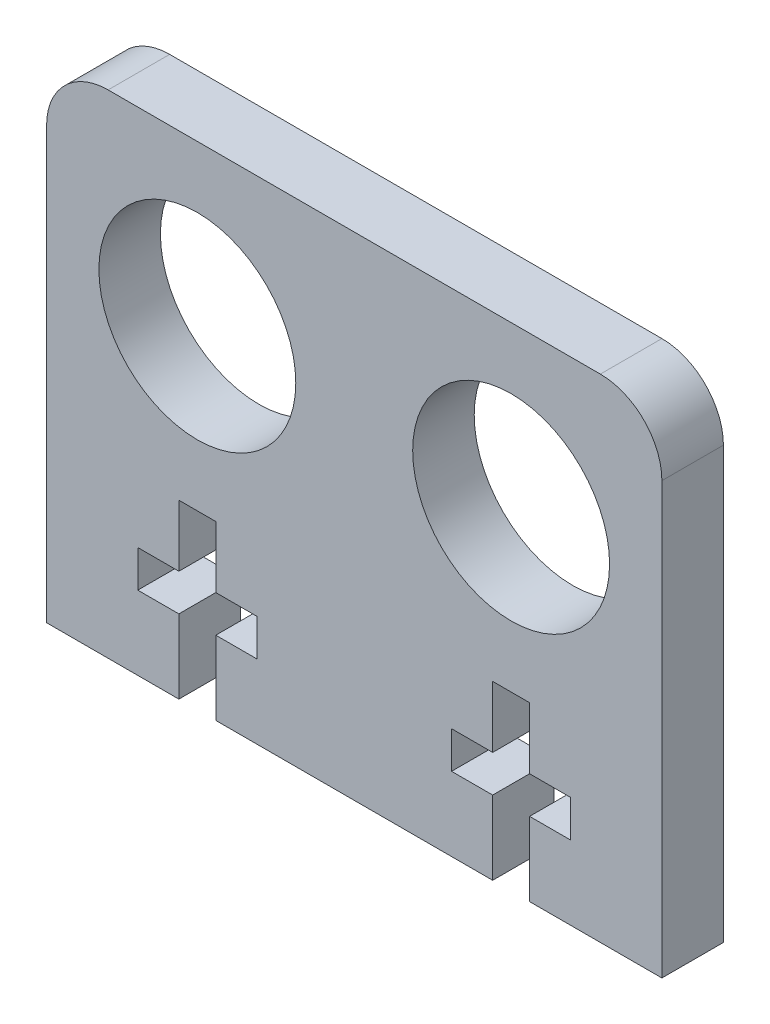
ISO-10303-21;
HEADER;
FILE_DESCRIPTION(('STEP AP214'),'2;1');
FILE_NAME('part.step','',(''),(''),'','','');
FILE_SCHEMA(('AUTOMOTIVE_DESIGN { 1 0 10303 214 1 1 1 1 }'));
ENDSEC;
DATA;
#1=APPLICATION_CONTEXT('core data for automotive mechanical design processes');
#2=APPLICATION_PROTOCOL_DEFINITION('international standard','automotive_design',2000,#1);
#3=PRODUCT_CONTEXT('',#1,'mechanical');
#4=PRODUCT('Part','Part','',(#3));
#5=PRODUCT_RELATED_PRODUCT_CATEGORY('part','',(#4));
#6=PRODUCT_DEFINITION_FORMATION('','',#4);
#7=PRODUCT_DEFINITION_CONTEXT('part definition',#1,'design');
#8=PRODUCT_DEFINITION('design','',#6,#7);
#9=PRODUCT_DEFINITION_SHAPE('','',#8);
#10=(LENGTH_UNIT() NAMED_UNIT(*) SI_UNIT(.MILLI.,.METRE.));
#11=(NAMED_UNIT(*) PLANE_ANGLE_UNIT() SI_UNIT($,.RADIAN.));
#12=(NAMED_UNIT(*) SI_UNIT($,.STERADIAN.) SOLID_ANGLE_UNIT());
#13=UNCERTAINTY_MEASURE_WITH_UNIT(LENGTH_MEASURE(1.E-05),#10,'distance_accuracy_value','');
#14=(GEOMETRIC_REPRESENTATION_CONTEXT(3) GLOBAL_UNCERTAINTY_ASSIGNED_CONTEXT((#13)) GLOBAL_UNIT_ASSIGNED_CONTEXT((#10,
#11,#12)) REPRESENTATION_CONTEXT('',''));
#15=CARTESIAN_POINT('',(0.,0.,0.));
#16=DIRECTION('',(0.,0.,1.));
#17=DIRECTION('',(1.,0.,0.));
#18=AXIS2_PLACEMENT_3D('',#15,#16,#17);
#19=CARTESIAN_POINT('',(-18.9894864370583,-13.233633688483,5.));
#20=DIRECTION('',(0.,1.,0.));
#21=DIRECTION('',(-1.,0.,0.));
#22=AXIS2_PLACEMENT_3D('',#19,#20,#21);
#23=PLANE('',#22);
#24=DIRECTION('',(1.,0.,0.));
#25=VECTOR('',#24,1.);
#26=CARTESIAN_POINT('',(-18.9894864370583,-13.233633688483,5.));
#27=LINE('',#26,#25);
#28=CARTESIAN_POINT('',(-5.23989682395063,-13.233633688483,5.));
#29=VERTEX_POINT('',#28);
#30=CARTESIAN_POINT('',(17.2601031760494,-13.233633688483,5.));
#31=VERTEX_POINT('',#30);
#32=EDGE_CURVE('E380',#29,#31,#27,.T.);
#33=ORIENTED_EDGE('',*,*,#32,.F.);
#34=DIRECTION('',(0.,0.,1.));
#35=VECTOR('',#34,1.);
#36=CARTESIAN_POINT('',(-5.23989682395063,-13.233633688483,-5.));
#37=LINE('',#36,#35);
#38=CARTESIAN_POINT('',(-5.23989682395063,-13.233633688483,0.));
#39=VERTEX_POINT('',#38);
#40=EDGE_CURVE('E297',#39,#29,#37,.T.);
#41=ORIENTED_EDGE('',*,*,#40,.F.);
#42=DIRECTION('',(1.,0.,0.));
#43=VECTOR('',#42,1.);
#44=CARTESIAN_POINT('',(-18.9894864370583,-13.233633688483,0.));
#45=LINE('',#44,#43);
#46=CARTESIAN_POINT('',(17.2601031760494,-13.233633688483,0.));
#47=VERTEX_POINT('',#46);
#48=EDGE_CURVE('E391',#39,#47,#45,.T.);
#49=ORIENTED_EDGE('',*,*,#48,.T.);
#50=DIRECTION('',(0.,0.,1.));
#51=VECTOR('',#50,1.);
#52=CARTESIAN_POINT('',(17.2601031760494,-13.233633688483,-5.));
#53=LINE('',#52,#51);
#54=EDGE_CURVE('E355',#47,#31,#53,.T.);
#55=ORIENTED_EDGE('',*,*,#54,.T.);
#56=EDGE_LOOP('',(#33,#41,#49,#55));
#57=FACE_BOUND('',#56,.T.);
#58=ADVANCED_FACE('F33',(#57),#23,.F.);
#59=CARTESIAN_POINT('',(20.2601031760494,-13.233633688483,5.));
#60=VERTEX_POINT('',#59);
#61=CARTESIAN_POINT('',(31.0105135629417,-13.233633688483,5.));
#62=VERTEX_POINT('',#61);
#63=EDGE_CURVE('E375',#60,#62,#27,.T.);
#64=ORIENTED_EDGE('',*,*,#63,.F.);
#65=DIRECTION('',(0.,0.,1.));
#66=VECTOR('',#65,1.);
#67=CARTESIAN_POINT('',(20.2601031760494,-13.233633688483,-5.));
#68=LINE('',#67,#66);
#69=CARTESIAN_POINT('',(20.2601031760494,-13.233633688483,0.));
#70=VERTEX_POINT('',#69);
#71=EDGE_CURVE('E353',#70,#60,#68,.T.);
#72=ORIENTED_EDGE('',*,*,#71,.F.);
#73=CARTESIAN_POINT('',(31.0105135629417,-13.233633688483,0.));
#74=VERTEX_POINT('',#73);
#75=EDGE_CURVE('E386',#70,#74,#45,.T.);
#76=ORIENTED_EDGE('',*,*,#75,.T.);
#77=DIRECTION('',(0.,0.,-1.));
#78=VECTOR('',#77,1.);
#79=CARTESIAN_POINT('',(31.0105135629417,-13.233633688483,5.));
#80=LINE('',#79,#78);
#81=EDGE_CURVE('E384',#62,#74,#80,.T.);
#82=ORIENTED_EDGE('',*,*,#81,.F.);
#83=EDGE_LOOP('',(#64,#72,#76,#82));
#84=FACE_BOUND('',#83,.T.);
#85=ADVANCED_FACE('F542',(#84),#23,.F.);
#86=CARTESIAN_POINT('',(-18.9894864370583,26.766366311517,5.));
#87=DIRECTION('',(1.,0.,0.));
#88=DIRECTION('',(0.,1.,0.));
#89=AXIS2_PLACEMENT_3D('',#86,#87,#88);
#90=PLANE('',#89);
#91=DIRECTION('',(0.,-1.,0.));
#92=VECTOR('',#91,1.);
#93=CARTESIAN_POINT('',(-18.9894864370583,26.766366311517,5.));
#94=LINE('',#93,#92);
#95=CARTESIAN_POINT('',(-18.9894864370583,21.766366311517,5.));
#96=VERTEX_POINT('',#95);
#97=CARTESIAN_POINT('',(-18.9894864370583,-13.233633688483,5.));
#98=VERTEX_POINT('',#97);
#99=EDGE_CURVE('E373',#96,#98,#94,.T.);
#100=ORIENTED_EDGE('',*,*,#99,.F.);
#101=DIRECTION('',(0.,0.,-1.));
#102=VECTOR('',#101,1.);
#103=CARTESIAN_POINT('',(-18.9894864370583,21.766366311517,5.));
#104=LINE('',#103,#102);
#105=CARTESIAN_POINT('',(-18.9894864370583,21.766366311517,0.));
#106=VERTEX_POINT('',#105);
#107=EDGE_CURVE('E462',#96,#106,#104,.T.);
#108=ORIENTED_EDGE('',*,*,#107,.T.);
#109=DIRECTION('',(0.,-1.,0.));
#110=VECTOR('',#109,1.);
#111=CARTESIAN_POINT('',(-18.9894864370583,26.766366311517,0.));
#112=LINE('',#111,#110);
#113=CARTESIAN_POINT('',(-18.9894864370583,-13.233633688483,0.));
#114=VERTEX_POINT('',#113);
#115=EDGE_CURVE('E370',#106,#114,#112,.T.);
#116=ORIENTED_EDGE('',*,*,#115,.T.);
#117=DIRECTION('',(0.,0.,-1.));
#118=VECTOR('',#117,1.);
#119=CARTESIAN_POINT('',(-18.9894864370583,-13.233633688483,5.));
#120=LINE('',#119,#118);
#121=EDGE_CURVE('E396',#98,#114,#120,.T.);
#122=ORIENTED_EDGE('',*,*,#121,.F.);
#123=EDGE_LOOP('',(#100,#108,#116,#122));
#124=FACE_BOUND('',#123,.T.);
#125=ADVANCED_FACE('F495',(#124),#90,.F.);
#126=CARTESIAN_POINT('',(-8.23989682395063,-13.233633688483,0.));
#127=VERTEX_POINT('',#126);
#128=EDGE_CURVE('E387',#114,#127,#45,.T.);
#129=ORIENTED_EDGE('',*,*,#128,.T.);
#130=DIRECTION('',(0.,0.,1.));
#131=VECTOR('',#130,1.);
#132=CARTESIAN_POINT('',(-8.23989682395063,-13.233633688483,-5.));
#133=LINE('',#132,#131);
#134=CARTESIAN_POINT('',(-8.23989682395063,-13.233633688483,5.));
#135=VERTEX_POINT('',#134);
#136=EDGE_CURVE('E299',#127,#135,#133,.T.);
#137=ORIENTED_EDGE('',*,*,#136,.T.);
#138=EDGE_CURVE('E377',#98,#135,#27,.T.);
#139=ORIENTED_EDGE('',*,*,#138,.F.);
#140=ORIENTED_EDGE('',*,*,#121,.T.);
#141=EDGE_LOOP('',(#129,#137,#139,#140));
#142=FACE_BOUND('',#141,.T.);
#143=ADVANCED_FACE('F497',(#142),#23,.F.);
#144=CARTESIAN_POINT('',(31.0105135629417,-13.233633688483,5.));
#145=DIRECTION('',(-1.,0.,0.));
#146=DIRECTION('',(0.,0.,1.));
#147=AXIS2_PLACEMENT_3D('',#144,#145,#146);
#148=PLANE('',#147);
#149=DIRECTION('',(0.,1.,0.));
#150=VECTOR('',#149,1.);
#151=CARTESIAN_POINT('',(31.0105135629417,-13.233633688483,0.));
#152=LINE('',#151,#150);
#153=CARTESIAN_POINT('',(31.0105135629417,21.766366311517,0.));
#154=VERTEX_POINT('',#153);
#155=EDGE_CURVE('E390',#74,#154,#152,.T.);
#156=ORIENTED_EDGE('',*,*,#155,.T.);
#157=DIRECTION('',(0.,0.,-1.));
#158=VECTOR('',#157,1.);
#159=CARTESIAN_POINT('',(31.0105135629417,21.766366311517,5.));
#160=LINE('',#159,#158);
#161=CARTESIAN_POINT('',(31.0105135629417,21.766366311517,5.));
#162=VERTEX_POINT('',#161);
#163=EDGE_CURVE('E41',#154,#162,#160,.F.);
#164=ORIENTED_EDGE('',*,*,#163,.T.);
#165=DIRECTION('',(0.,1.,0.));
#166=VECTOR('',#165,1.);
#167=CARTESIAN_POINT('',(31.0105135629417,-13.233633688483,5.));
#168=LINE('',#167,#166);
#169=EDGE_CURVE('E379',#62,#162,#168,.T.);
#170=ORIENTED_EDGE('',*,*,#169,.F.);
#171=ORIENTED_EDGE('',*,*,#81,.T.);
#172=EDGE_LOOP('',(#156,#164,#170,#171));
#173=FACE_BOUND('',#172,.T.);
#174=ADVANCED_FACE('F544',(#173),#148,.F.);
#175=CARTESIAN_POINT('',(31.0105135629417,26.766366311517,5.));
#176=DIRECTION('',(0.,-1.,0.));
#177=DIRECTION('',(1.,0.,0.));
#178=AXIS2_PLACEMENT_3D('',#175,#176,#177);
#179=PLANE('',#178);
#180=DIRECTION('',(-1.,0.,0.));
#181=VECTOR('',#180,1.);
#182=CARTESIAN_POINT('',(31.0105135629417,26.766366311517,5.));
#183=LINE('',#182,#181);
#184=CARTESIAN_POINT('',(26.0105135629417,26.766366311517,5.));
#185=VERTEX_POINT('',#184);
#186=CARTESIAN_POINT('',(-13.9894864370583,26.766366311517,5.));
#187=VERTEX_POINT('',#186);
#188=EDGE_CURVE('E382',#185,#187,#183,.T.);
#189=ORIENTED_EDGE('',*,*,#188,.F.);
#190=DIRECTION('',(0.,0.,-1.));
#191=VECTOR('',#190,1.);
#192=CARTESIAN_POINT('',(26.0105135629417,26.766366311517,5.));
#193=LINE('',#192,#191);
#194=CARTESIAN_POINT('',(26.0105135629417,26.766366311517,0.));
#195=VERTEX_POINT('',#194);
#196=EDGE_CURVE('E473',#185,#195,#193,.T.);
#197=ORIENTED_EDGE('',*,*,#196,.T.);
#198=DIRECTION('',(-1.,0.,0.));
#199=VECTOR('',#198,1.);
#200=CARTESIAN_POINT('',(31.0105135629417,26.766366311517,0.));
#201=LINE('',#200,#199);
#202=CARTESIAN_POINT('',(-13.9894864370583,26.766366311517,0.));
#203=VERTEX_POINT('',#202);
#204=EDGE_CURVE('E376',#195,#203,#201,.T.);
#205=ORIENTED_EDGE('',*,*,#204,.T.);
#206=DIRECTION('',(0.,0.,-1.));
#207=VECTOR('',#206,1.);
#208=CARTESIAN_POINT('',(-13.9894864370583,26.766366311517,5.));
#209=LINE('',#208,#207);
#210=EDGE_CURVE('E468',#203,#187,#209,.F.);
#211=ORIENTED_EDGE('',*,*,#210,.T.);
#212=EDGE_LOOP('',(#189,#197,#205,#211));
#213=FACE_BOUND('',#212,.T.);
#214=ADVANCED_FACE('F479',(#213),#179,.F.);
#215=CARTESIAN_POINT('',(0.,0.,5.));
#216=DIRECTION('',(0.,0.,1.));
#217=DIRECTION('',(1.,0.,0.));
#218=AXIS2_PLACEMENT_3D('',#215,#216,#217);
#219=PLANE('',#218);
#220=ORIENTED_EDGE('',*,*,#169,.T.);
#221=CARTESIAN_POINT('',(26.0105135629417,21.766366311517,5.));
#222=DIRECTION('',(0.,0.,1.));
#223=DIRECTION('',(1.,0.,0.));
#224=AXIS2_PLACEMENT_3D('',#221,#222,#223);
#225=CIRCLE('',#224,5.);
#226=EDGE_CURVE('E11',#162,#185,#225,.T.);
#227=ORIENTED_EDGE('',*,*,#226,.T.);
#228=ORIENTED_EDGE('',*,*,#188,.T.);
#229=CARTESIAN_POINT('',(-13.9894864370583,21.766366311517,5.));
#230=DIRECTION('',(0.,0.,1.));
#231=DIRECTION('',(1.,0.,0.));
#232=AXIS2_PLACEMENT_3D('',#229,#230,#231);
#233=CIRCLE('',#232,5.);
#234=EDGE_CURVE('E471',#187,#96,#233,.T.);
#235=ORIENTED_EDGE('',*,*,#234,.T.);
#236=ORIENTED_EDGE('',*,*,#99,.T.);
#237=ORIENTED_EDGE('',*,*,#138,.T.);
#238=DIRECTION('',(0.,-1.,0.));
#239=VECTOR('',#238,1.);
#240=CARTESIAN_POINT('',(-8.23989682395063,-13.233633688483,5.));
#241=LINE('',#240,#239);
#242=CARTESIAN_POINT('',(-8.23989682395063,-7.23363368848302,5.));
#243=VERTEX_POINT('',#242);
#244=EDGE_CURVE('E255',#243,#135,#241,.T.);
#245=ORIENTED_EDGE('',*,*,#244,.F.);
#246=DIRECTION('',(1.,0.,0.));
#247=VECTOR('',#246,1.);
#248=CARTESIAN_POINT('',(-8.23989682395063,-7.23363368848302,5.));
#249=LINE('',#248,#247);
#250=CARTESIAN_POINT('',(-11.5798968239506,-7.23363368848302,5.));
#251=VERTEX_POINT('',#250);
#252=EDGE_CURVE('E234',#251,#243,#249,.T.);
#253=ORIENTED_EDGE('',*,*,#252,.F.);
#254=DIRECTION('',(0.,-1.,0.));
#255=VECTOR('',#254,1.);
#256=CARTESIAN_POINT('',(-11.5798968239506,-7.23363368848302,5.));
#257=LINE('',#256,#255);
#258=CARTESIAN_POINT('',(-11.5798968239506,-4.23363368848298,5.));
#259=VERTEX_POINT('',#258);
#260=EDGE_CURVE('E244',#259,#251,#257,.T.);
#261=ORIENTED_EDGE('',*,*,#260,.F.);
#262=DIRECTION('',(-1.,0.,0.));
#263=VECTOR('',#262,1.);
#264=CARTESIAN_POINT('',(-11.5798968239506,-4.23363368848298,5.));
#265=LINE('',#264,#263);
#266=CARTESIAN_POINT('',(-8.23989682395063,-4.23363368848299,5.));
#267=VERTEX_POINT('',#266);
#268=EDGE_CURVE('E241',#267,#259,#265,.T.);
#269=ORIENTED_EDGE('',*,*,#268,.F.);
#270=DIRECTION('',(0.,-1.,0.));
#271=VECTOR('',#270,1.);
#272=CARTESIAN_POINT('',(-8.23989682395063,-4.23363368848299,5.));
#273=LINE('',#272,#271);
#274=CARTESIAN_POINT('',(-8.23989682395063,0.766366311517015,5.));
#275=VERTEX_POINT('',#274);
#276=EDGE_CURVE('E277',#275,#267,#273,.T.);
#277=ORIENTED_EDGE('',*,*,#276,.F.);
#278=DIRECTION('',(-1.,0.,0.));
#279=VECTOR('',#278,1.);
#280=CARTESIAN_POINT('',(-8.23989682395063,0.766366311517015,5.));
#281=LINE('',#280,#279);
#282=CARTESIAN_POINT('',(-5.23989682395063,0.766366311517015,5.));
#283=VERTEX_POINT('',#282);
#284=EDGE_CURVE('E274',#283,#275,#281,.T.);
#285=ORIENTED_EDGE('',*,*,#284,.F.);
#286=DIRECTION('',(0.,1.,0.));
#287=VECTOR('',#286,1.);
#288=CARTESIAN_POINT('',(-5.23989682395063,0.766366311517015,5.));
#289=LINE('',#288,#287);
#290=CARTESIAN_POINT('',(-5.23989682395063,-4.23363368848299,5.));
#291=VERTEX_POINT('',#290);
#292=EDGE_CURVE('E271',#291,#283,#289,.T.);
#293=ORIENTED_EDGE('',*,*,#292,.F.);
#294=DIRECTION('',(-1.,0.,0.));
#295=VECTOR('',#294,1.);
#296=CARTESIAN_POINT('',(-5.23989682395063,-4.23363368848299,5.));
#297=LINE('',#296,#295);
#298=CARTESIAN_POINT('',(-1.89989682395061,-4.23363368848298,5.));
#299=VERTEX_POINT('',#298);
#300=EDGE_CURVE('E268',#299,#291,#297,.T.);
#301=ORIENTED_EDGE('',*,*,#300,.F.);
#302=DIRECTION('',(0.,1.,0.));
#303=VECTOR('',#302,1.);
#304=CARTESIAN_POINT('',(-1.89989682395061,-4.23363368848298,5.));
#305=LINE('',#304,#303);
#306=CARTESIAN_POINT('',(-1.89989682395061,-7.23363368848302,5.));
#307=VERTEX_POINT('',#306);
#308=EDGE_CURVE('E265',#307,#299,#305,.T.);
#309=ORIENTED_EDGE('',*,*,#308,.F.);
#310=DIRECTION('',(1.,0.,0.));
#311=VECTOR('',#310,1.);
#312=CARTESIAN_POINT('',(-1.89989682395061,-7.23363368848302,5.));
#313=LINE('',#312,#311);
#314=CARTESIAN_POINT('',(-5.23989682395063,-7.23363368848302,5.));
#315=VERTEX_POINT('',#314);
#316=EDGE_CURVE('E262',#315,#307,#313,.T.);
#317=ORIENTED_EDGE('',*,*,#316,.F.);
#318=DIRECTION('',(0.,1.,0.));
#319=VECTOR('',#318,1.);
#320=CARTESIAN_POINT('',(-5.23989682395063,-7.23363368848302,5.));
#321=LINE('',#320,#319);
#322=EDGE_CURVE('E257',#29,#315,#321,.T.);
#323=ORIENTED_EDGE('',*,*,#322,.F.);
#324=ORIENTED_EDGE('',*,*,#32,.T.);
#325=DIRECTION('',(0.,-1.,0.));
#326=VECTOR('',#325,1.);
#327=CARTESIAN_POINT('',(17.2601031760494,-13.233633688483,5.));
#328=LINE('',#327,#326);
#329=CARTESIAN_POINT('',(17.2601031760494,-7.23363368848302,5.));
#330=VERTEX_POINT('',#329);
#331=EDGE_CURVE('E308',#330,#31,#328,.T.);
#332=ORIENTED_EDGE('',*,*,#331,.F.);
#333=DIRECTION('',(1.,0.,0.));
#334=VECTOR('',#333,1.);
#335=CARTESIAN_POINT('',(17.2601031760494,-7.23363368848302,5.));
#336=LINE('',#335,#334);
#337=CARTESIAN_POINT('',(13.9201031760494,-7.23363368848302,5.));
#338=VERTEX_POINT('',#337);
#339=EDGE_CURVE('E305',#338,#330,#336,.T.);
#340=ORIENTED_EDGE('',*,*,#339,.F.);
#341=DIRECTION('',(0.,-1.,0.));
#342=VECTOR('',#341,1.);
#343=CARTESIAN_POINT('',(13.9201031760494,-7.23363368848302,5.));
#344=LINE('',#343,#342);
#345=CARTESIAN_POINT('',(13.9201031760493,-4.23363368848299,5.));
#346=VERTEX_POINT('',#345);
#347=EDGE_CURVE('E282',#346,#338,#344,.T.);
#348=ORIENTED_EDGE('',*,*,#347,.F.);
#349=DIRECTION('',(-1.,0.,0.));
#350=VECTOR('',#349,1.);
#351=CARTESIAN_POINT('',(13.9201031760493,-4.23363368848299,5.));
#352=LINE('',#351,#350);
#353=CARTESIAN_POINT('',(17.2601031760494,-4.23363368848299,5.));
#354=VERTEX_POINT('',#353);
#355=EDGE_CURVE('E332',#354,#346,#352,.T.);
#356=ORIENTED_EDGE('',*,*,#355,.F.);
#357=DIRECTION('',(0.,-1.,0.));
#358=VECTOR('',#357,1.);
#359=CARTESIAN_POINT('',(17.2601031760494,-4.23363368848299,5.));
#360=LINE('',#359,#358);
#361=CARTESIAN_POINT('',(17.2601031760494,0.766366311517015,5.));
#362=VERTEX_POINT('',#361);
#363=EDGE_CURVE('E329',#362,#354,#360,.T.);
#364=ORIENTED_EDGE('',*,*,#363,.F.);
#365=DIRECTION('',(-1.,0.,0.));
#366=VECTOR('',#365,1.);
#367=CARTESIAN_POINT('',(17.2601031760494,0.766366311517015,5.));
#368=LINE('',#367,#366);
#369=CARTESIAN_POINT('',(20.2601031760494,0.766366311517015,5.));
#370=VERTEX_POINT('',#369);
#371=EDGE_CURVE('E326',#370,#362,#368,.T.);
#372=ORIENTED_EDGE('',*,*,#371,.F.);
#373=DIRECTION('',(0.,1.,0.));
#374=VECTOR('',#373,1.);
#375=CARTESIAN_POINT('',(20.2601031760494,0.766366311517015,5.));
#376=LINE('',#375,#374);
#377=CARTESIAN_POINT('',(20.2601031760494,-4.23363368848299,5.));
#378=VERTEX_POINT('',#377);
#379=EDGE_CURVE('E323',#378,#370,#376,.T.);
#380=ORIENTED_EDGE('',*,*,#379,.F.);
#381=DIRECTION('',(-1.,0.,0.));
#382=VECTOR('',#381,1.);
#383=CARTESIAN_POINT('',(20.2601031760494,-4.23363368848299,5.));
#384=LINE('',#383,#382);
#385=CARTESIAN_POINT('',(23.6001031760494,-4.23363368848298,5.));
#386=VERTEX_POINT('',#385);
#387=EDGE_CURVE('E320',#386,#378,#384,.T.);
#388=ORIENTED_EDGE('',*,*,#387,.F.);
#389=DIRECTION('',(0.,1.,0.));
#390=VECTOR('',#389,1.);
#391=CARTESIAN_POINT('',(23.6001031760494,-4.23363368848298,5.));
#392=LINE('',#391,#390);
#393=CARTESIAN_POINT('',(23.6001031760494,-7.23363368848302,5.));
#394=VERTEX_POINT('',#393);
#395=EDGE_CURVE('E317',#394,#386,#392,.T.);
#396=ORIENTED_EDGE('',*,*,#395,.F.);
#397=DIRECTION('',(1.,0.,0.));
#398=VECTOR('',#397,1.);
#399=CARTESIAN_POINT('',(23.6001031760494,-7.23363368848302,5.));
#400=LINE('',#399,#398);
#401=CARTESIAN_POINT('',(20.2601031760494,-7.23363368848302,5.));
#402=VERTEX_POINT('',#401);
#403=EDGE_CURVE('E314',#402,#394,#400,.T.);
#404=ORIENTED_EDGE('',*,*,#403,.F.);
#405=DIRECTION('',(0.,1.,0.));
#406=VECTOR('',#405,1.);
#407=CARTESIAN_POINT('',(20.2601031760494,-7.23363368848302,5.));
#408=LINE('',#407,#406);
#409=EDGE_CURVE('E311',#60,#402,#408,.T.);
#410=ORIENTED_EDGE('',*,*,#409,.F.);
#411=ORIENTED_EDGE('',*,*,#63,.T.);
#412=EDGE_LOOP('',(#220,#227,#228,#235,#236,#237,#245,#253,#261,#269,#277,#285,#293,#301,#309,
#317,#323,#324,#332,#340,#348,#356,#364,#372,#380,#388,#396,#404,#410,#411));
#413=FACE_BOUND('',#412,.T.);
#414=CARTESIAN_POINT('',(-6.73989682395063,13.766366311517,5.));
#415=DIRECTION('',(0.,0.,-1.));
#416=DIRECTION('',(-1.,0.,0.));
#417=AXIS2_PLACEMENT_3D('',#414,#415,#416);
#418=CIRCLE('',#417,8.);
#419=CARTESIAN_POINT('',(-14.7398968239506,13.766366311517,5.));
#420=VERTEX_POINT('',#419);
#421=EDGE_CURVE('E361',#420,#420,#418,.T.);
#422=ORIENTED_EDGE('',*,*,#421,.T.);
#423=EDGE_LOOP('',(#422));
#424=FACE_BOUND('',#423,.T.);
#425=CARTESIAN_POINT('',(18.7601031760494,13.766366311517,5.));
#426=DIRECTION('',(0.,0.,-1.));
#427=DIRECTION('',(-1.,0.,0.));
#428=AXIS2_PLACEMENT_3D('',#425,#426,#427);
#429=CIRCLE('',#428,8.);
#430=CARTESIAN_POINT('',(10.7601031760494,13.766366311517,5.));
#431=VERTEX_POINT('',#430);
#432=EDGE_CURVE('E367',#431,#431,#429,.T.);
#433=ORIENTED_EDGE('',*,*,#432,.T.);
#434=EDGE_LOOP('',(#433));
#435=FACE_BOUND('',#434,.T.);
#436=ADVANCED_FACE('F252',(#413,#424,#435),#219,.T.);
#437=CARTESIAN_POINT('',(0.,0.,0.));
#438=DIRECTION('',(0.,0.,1.));
#439=DIRECTION('',(1.,0.,0.));
#440=AXIS2_PLACEMENT_3D('',#437,#438,#439);
#441=PLANE('',#440);
#442=ORIENTED_EDGE('',*,*,#204,.F.);
#443=CARTESIAN_POINT('',(26.0105135629417,21.766366311517,0.));
#444=DIRECTION('',(0.,0.,1.));
#445=DIRECTION('',(1.,0.,0.));
#446=AXIS2_PLACEMENT_3D('',#443,#444,#445);
#447=CIRCLE('',#446,5.);
#448=EDGE_CURVE('E55',#195,#154,#447,.F.);
#449=ORIENTED_EDGE('',*,*,#448,.T.);
#450=ORIENTED_EDGE('',*,*,#155,.F.);
#451=ORIENTED_EDGE('',*,*,#75,.F.);
#452=DIRECTION('',(0.,1.,0.));
#453=VECTOR('',#452,1.);
#454=CARTESIAN_POINT('',(20.2601031760493,0.,0.));
#455=LINE('',#454,#453);
#456=CARTESIAN_POINT('',(20.2601031760494,-7.23363368848302,0.));
#457=VERTEX_POINT('',#456);
#458=EDGE_CURVE('E429',#70,#457,#455,.T.);
#459=ORIENTED_EDGE('',*,*,#458,.T.);
#460=DIRECTION('',(1.,0.,0.));
#461=VECTOR('',#460,1.);
#462=CARTESIAN_POINT('',(0.,-7.23363368848302,0.));
#463=LINE('',#462,#461);
#464=CARTESIAN_POINT('',(23.6001031760494,-7.23363368848302,0.));
#465=VERTEX_POINT('',#464);
#466=EDGE_CURVE('E426',#457,#465,#463,.T.);
#467=ORIENTED_EDGE('',*,*,#466,.T.);
#468=DIRECTION('',(0.,1.,0.));
#469=VECTOR('',#468,1.);
#470=CARTESIAN_POINT('',(23.6001031760494,0.,0.));
#471=LINE('',#470,#469);
#472=CARTESIAN_POINT('',(23.6001031760494,-4.23363368848298,0.));
#473=VERTEX_POINT('',#472);
#474=EDGE_CURVE('E423',#465,#473,#471,.T.);
#475=ORIENTED_EDGE('',*,*,#474,.T.);
#476=DIRECTION('',(-1.,0.,0.));
#477=VECTOR('',#476,1.);
#478=CARTESIAN_POINT('',(0.,-4.23363368848299,0.));
#479=LINE('',#478,#477);
#480=CARTESIAN_POINT('',(20.2601031760494,-4.23363368848299,0.));
#481=VERTEX_POINT('',#480);
#482=EDGE_CURVE('E420',#473,#481,#479,.T.);
#483=ORIENTED_EDGE('',*,*,#482,.T.);
#484=DIRECTION('',(0.,1.,0.));
#485=VECTOR('',#484,1.);
#486=CARTESIAN_POINT('',(20.2601031760494,0.,0.));
#487=LINE('',#486,#485);
#488=CARTESIAN_POINT('',(20.2601031760494,0.766366311517015,0.));
#489=VERTEX_POINT('',#488);
#490=EDGE_CURVE('E417',#481,#489,#487,.T.);
#491=ORIENTED_EDGE('',*,*,#490,.T.);
#492=DIRECTION('',(-1.,0.,0.));
#493=VECTOR('',#492,1.);
#494=CARTESIAN_POINT('',(0.,0.766366311517013,0.));
#495=LINE('',#494,#493);
#496=CARTESIAN_POINT('',(17.2601031760494,0.766366311517015,0.));
#497=VERTEX_POINT('',#496);
#498=EDGE_CURVE('E414',#489,#497,#495,.T.);
#499=ORIENTED_EDGE('',*,*,#498,.T.);
#500=DIRECTION('',(0.,-1.,0.));
#501=VECTOR('',#500,1.);
#502=CARTESIAN_POINT('',(17.2601031760494,0.,0.));
#503=LINE('',#502,#501);
#504=CARTESIAN_POINT('',(17.2601031760494,-4.23363368848299,0.));
#505=VERTEX_POINT('',#504);
#506=EDGE_CURVE('E411',#497,#505,#503,.T.);
#507=ORIENTED_EDGE('',*,*,#506,.T.);
#508=DIRECTION('',(-1.,0.,0.));
#509=VECTOR('',#508,1.);
#510=CARTESIAN_POINT('',(0.,-4.23363368848299,0.));
#511=LINE('',#510,#509);
#512=CARTESIAN_POINT('',(13.9201031760493,-4.23363368848299,0.));
#513=VERTEX_POINT('',#512);
#514=EDGE_CURVE('E408',#505,#513,#511,.T.);
#515=ORIENTED_EDGE('',*,*,#514,.T.);
#516=DIRECTION('',(0.,-1.,0.));
#517=VECTOR('',#516,1.);
#518=CARTESIAN_POINT('',(13.9201031760493,0.,0.));
#519=LINE('',#518,#517);
#520=CARTESIAN_POINT('',(13.9201031760494,-7.23363368848302,0.));
#521=VERTEX_POINT('',#520);
#522=EDGE_CURVE('E405',#513,#521,#519,.T.);
#523=ORIENTED_EDGE('',*,*,#522,.T.);
#524=DIRECTION('',(1.,0.,0.));
#525=VECTOR('',#524,1.);
#526=CARTESIAN_POINT('',(0.,-7.23363368848302,0.));
#527=LINE('',#526,#525);
#528=CARTESIAN_POINT('',(17.2601031760494,-7.23363368848302,0.));
#529=VERTEX_POINT('',#528);
#530=EDGE_CURVE('E399',#521,#529,#527,.T.);
#531=ORIENTED_EDGE('',*,*,#530,.T.);
#532=DIRECTION('',(0.,-1.,0.));
#533=VECTOR('',#532,1.);
#534=CARTESIAN_POINT('',(17.2601031760494,0.,0.));
#535=LINE('',#534,#533);
#536=EDGE_CURVE('E402',#529,#47,#535,.T.);
#537=ORIENTED_EDGE('',*,*,#536,.T.);
#538=ORIENTED_EDGE('',*,*,#48,.F.);
#539=DIRECTION('',(0.,1.,0.));
#540=VECTOR('',#539,1.);
#541=CARTESIAN_POINT('',(-5.23989682395063,0.,0.));
#542=LINE('',#541,#540);
#543=CARTESIAN_POINT('',(-5.23989682395063,-7.23363368848302,0.));
#544=VERTEX_POINT('',#543);
#545=EDGE_CURVE('E459',#39,#544,#542,.T.);
#546=ORIENTED_EDGE('',*,*,#545,.T.);
#547=DIRECTION('',(1.,0.,0.));
#548=VECTOR('',#547,1.);
#549=CARTESIAN_POINT('',(0.,-7.23363368848302,0.));
#550=LINE('',#549,#548);
#551=CARTESIAN_POINT('',(-1.89989682395061,-7.23363368848302,0.));
#552=VERTEX_POINT('',#551);
#553=EDGE_CURVE('E456',#544,#552,#550,.T.);
#554=ORIENTED_EDGE('',*,*,#553,.T.);
#555=DIRECTION('',(0.,1.,0.));
#556=VECTOR('',#555,1.);
#557=CARTESIAN_POINT('',(-1.89989682395061,0.,0.));
#558=LINE('',#557,#556);
#559=CARTESIAN_POINT('',(-1.89989682395061,-4.23363368848298,0.));
#560=VERTEX_POINT('',#559);
#561=EDGE_CURVE('E453',#552,#560,#558,.T.);
#562=ORIENTED_EDGE('',*,*,#561,.T.);
#563=DIRECTION('',(-1.,0.,0.));
#564=VECTOR('',#563,1.);
#565=CARTESIAN_POINT('',(0.,-4.23363368848298,0.));
#566=LINE('',#565,#564);
#567=CARTESIAN_POINT('',(-5.23989682395063,-4.23363368848299,0.));
#568=VERTEX_POINT('',#567);
#569=EDGE_CURVE('E450',#560,#568,#566,.T.);
#570=ORIENTED_EDGE('',*,*,#569,.T.);
#571=DIRECTION('',(0.,1.,0.));
#572=VECTOR('',#571,1.);
#573=CARTESIAN_POINT('',(-5.23989682395063,0.,0.));
#574=LINE('',#573,#572);
#575=CARTESIAN_POINT('',(-5.23989682395063,0.766366311517015,0.));
#576=VERTEX_POINT('',#575);
#577=EDGE_CURVE('E447',#568,#576,#574,.T.);
#578=ORIENTED_EDGE('',*,*,#577,.T.);
#579=DIRECTION('',(-1.,0.,0.));
#580=VECTOR('',#579,1.);
#581=CARTESIAN_POINT('',(0.,0.766366311517016,0.));
#582=LINE('',#581,#580);
#583=CARTESIAN_POINT('',(-8.23989682395063,0.766366311517015,0.));
#584=VERTEX_POINT('',#583);
#585=EDGE_CURVE('E444',#576,#584,#582,.T.);
#586=ORIENTED_EDGE('',*,*,#585,.T.);
#587=DIRECTION('',(0.,-1.,0.));
#588=VECTOR('',#587,1.);
#589=CARTESIAN_POINT('',(-8.23989682395063,0.,0.));
#590=LINE('',#589,#588);
#591=CARTESIAN_POINT('',(-8.23989682395063,-4.23363368848299,0.));
#592=VERTEX_POINT('',#591);
#593=EDGE_CURVE('E441',#584,#592,#590,.T.);
#594=ORIENTED_EDGE('',*,*,#593,.T.);
#595=DIRECTION('',(-1.,0.,0.));
#596=VECTOR('',#595,1.);
#597=CARTESIAN_POINT('',(0.,-4.23363368848299,0.));
#598=LINE('',#597,#596);
#599=CARTESIAN_POINT('',(-11.5798968239506,-4.23363368848298,0.));
#600=VERTEX_POINT('',#599);
#601=EDGE_CURVE('E438',#592,#600,#598,.T.);
#602=ORIENTED_EDGE('',*,*,#601,.T.);
#603=DIRECTION('',(0.,-1.,0.));
#604=VECTOR('',#603,1.);
#605=CARTESIAN_POINT('',(-11.5798968239506,0.,0.));
#606=LINE('',#605,#604);
#607=CARTESIAN_POINT('',(-11.5798968239506,-7.23363368848302,0.));
#608=VERTEX_POINT('',#607);
#609=EDGE_CURVE('E436',#600,#608,#606,.T.);
#610=ORIENTED_EDGE('',*,*,#609,.T.);
#611=DIRECTION('',(1.,0.,0.));
#612=VECTOR('',#611,1.);
#613=CARTESIAN_POINT('',(0.,-7.23363368848302,0.));
#614=LINE('',#613,#612);
#615=CARTESIAN_POINT('',(-8.23989682395063,-7.23363368848302,0.));
#616=VERTEX_POINT('',#615);
#617=EDGE_CURVE('E237',#608,#616,#614,.T.);
#618=ORIENTED_EDGE('',*,*,#617,.T.);
#619=DIRECTION('',(0.,-1.,0.));
#620=VECTOR('',#619,1.);
#621=CARTESIAN_POINT('',(-8.23989682395063,0.,0.));
#622=LINE('',#621,#620);
#623=EDGE_CURVE('E433',#616,#127,#622,.T.);
#624=ORIENTED_EDGE('',*,*,#623,.T.);
#625=ORIENTED_EDGE('',*,*,#128,.F.);
#626=ORIENTED_EDGE('',*,*,#115,.F.);
#627=CARTESIAN_POINT('',(-13.9894864370583,21.766366311517,0.));
#628=DIRECTION('',(0.,0.,1.));
#629=DIRECTION('',(1.,0.,0.));
#630=AXIS2_PLACEMENT_3D('',#627,#628,#629);
#631=CIRCLE('',#630,5.);
#632=EDGE_CURVE('E465',#106,#203,#631,.F.);
#633=ORIENTED_EDGE('',*,*,#632,.T.);
#634=EDGE_LOOP('',(#442,#449,#450,#451,#459,#467,#475,#483,#491,#499,#507,#515,#523,#531,#537,
#538,#546,#554,#562,#570,#578,#586,#594,#602,#610,#618,#624,#625,#626,#633));
#635=FACE_BOUND('',#634,.T.);
#636=CARTESIAN_POINT('',(-6.73989682395063,13.766366311517,0.));
#637=DIRECTION('',(0.,0.,-1.));
#638=DIRECTION('',(-1.,0.,0.));
#639=AXIS2_PLACEMENT_3D('',#636,#637,#638);
#640=CIRCLE('',#639,8.);
#641=CARTESIAN_POINT('',(-14.7398968239506,13.766366311517,0.));
#642=VERTEX_POINT('',#641);
#643=EDGE_CURVE('E338',#642,#642,#640,.T.);
#644=ORIENTED_EDGE('',*,*,#643,.F.);
#645=EDGE_LOOP('',(#644));
#646=FACE_BOUND('',#645,.T.);
#647=CARTESIAN_POINT('',(18.7601031760494,13.766366311517,0.));
#648=DIRECTION('',(0.,0.,-1.));
#649=DIRECTION('',(-1.,0.,0.));
#650=AXIS2_PLACEMENT_3D('',#647,#648,#649);
#651=CIRCLE('',#650,8.);
#652=CARTESIAN_POINT('',(10.7601031760494,13.766366311517,0.));
#653=VERTEX_POINT('',#652);
#654=EDGE_CURVE('E364',#653,#653,#651,.T.);
#655=ORIENTED_EDGE('',*,*,#654,.F.);
#656=EDGE_LOOP('',(#655));
#657=FACE_BOUND('',#656,.T.);
#658=ADVANCED_FACE('F482',(#635,#646,#657),#441,.F.);
#659=CARTESIAN_POINT('',(18.7601031760494,13.766366311517,5.));
#660=DIRECTION('',(0.,0.,-1.));
#661=DIRECTION('',(-1.,0.,0.));
#662=AXIS2_PLACEMENT_3D('',#659,#660,#661);
#663=CYLINDRICAL_SURFACE('',#662,8.);
#664=ORIENTED_EDGE('',*,*,#432,.F.);
#665=EDGE_LOOP('',(#664));
#666=FACE_BOUND('',#665,.T.);
#667=ORIENTED_EDGE('',*,*,#654,.T.);
#668=EDGE_LOOP('',(#667));
#669=FACE_BOUND('',#668,.T.);
#670=ADVANCED_FACE('F621',(#666,#669),#663,.F.);
#671=CARTESIAN_POINT('',(-6.73989682395063,13.766366311517,5.));
#672=DIRECTION('',(0.,0.,-1.));
#673=DIRECTION('',(-1.,0.,0.));
#674=AXIS2_PLACEMENT_3D('',#671,#672,#673);
#675=CYLINDRICAL_SURFACE('',#674,8.);
#676=ORIENTED_EDGE('',*,*,#421,.F.);
#677=EDGE_LOOP('',(#676));
#678=FACE_BOUND('',#677,.T.);
#679=ORIENTED_EDGE('',*,*,#643,.T.);
#680=EDGE_LOOP('',(#679));
#681=FACE_BOUND('',#680,.T.);
#682=ADVANCED_FACE('F617',(#678,#681),#675,.F.);
#683=CARTESIAN_POINT('',(13.9201031760494,-7.23363368848302,-5.));
#684=DIRECTION('',(-1.,0.,0.));
#685=DIRECTION('',(0.,-1.,0.));
#686=AXIS2_PLACEMENT_3D('',#683,#684,#685);
#687=PLANE('',#686);
#688=DIRECTION('',(0.,0.,1.));
#689=VECTOR('',#688,1.);
#690=CARTESIAN_POINT('',(13.9201031760493,-4.23363368848299,-5.));
#691=LINE('',#690,#689);
#692=EDGE_CURVE('E336',#513,#346,#691,.T.);
#693=ORIENTED_EDGE('',*,*,#692,.T.);
#694=ORIENTED_EDGE('',*,*,#347,.T.);
#695=DIRECTION('',(0.,0.,1.));
#696=VECTOR('',#695,1.);
#697=CARTESIAN_POINT('',(13.9201031760494,-7.23363368848302,-5.));
#698=LINE('',#697,#696);
#699=EDGE_CURVE('E335',#521,#338,#698,.T.);
#700=ORIENTED_EDGE('',*,*,#699,.F.);
#701=ORIENTED_EDGE('',*,*,#522,.F.);
#702=EDGE_LOOP('',(#693,#694,#700,#701));
#703=FACE_BOUND('',#702,.T.);
#704=ADVANCED_FACE('F579',(#703),#687,.F.);
#705=CARTESIAN_POINT('',(13.9201031760493,-4.23363368848299,-5.));
#706=DIRECTION('',(0.,1.,0.));
#707=DIRECTION('',(0.,0.,1.));
#708=AXIS2_PLACEMENT_3D('',#705,#706,#707);
#709=PLANE('',#708);
#710=DIRECTION('',(0.,0.,1.));
#711=VECTOR('',#710,1.);
#712=CARTESIAN_POINT('',(17.2601031760494,-4.23363368848299,-5.));
#713=LINE('',#712,#711);
#714=EDGE_CURVE('E339',#505,#354,#713,.T.);
#715=ORIENTED_EDGE('',*,*,#714,.T.);
#716=ORIENTED_EDGE('',*,*,#355,.T.);
#717=ORIENTED_EDGE('',*,*,#692,.F.);
#718=ORIENTED_EDGE('',*,*,#514,.F.);
#719=EDGE_LOOP('',(#715,#716,#717,#718));
#720=FACE_BOUND('',#719,.T.);
#721=ADVANCED_FACE('F575',(#720),#709,.F.);
#722=CARTESIAN_POINT('',(17.2601031760494,-4.23363368848299,-5.));
#723=DIRECTION('',(-1.,0.,0.));
#724=DIRECTION('',(0.,0.,1.));
#725=AXIS2_PLACEMENT_3D('',#722,#723,#724);
#726=PLANE('',#725);
#727=DIRECTION('',(0.,0.,1.));
#728=VECTOR('',#727,1.);
#729=CARTESIAN_POINT('',(17.2601031760494,0.766366311517015,-5.));
#730=LINE('',#729,#728);
#731=EDGE_CURVE('E341',#497,#362,#730,.T.);
#732=ORIENTED_EDGE('',*,*,#731,.T.);
#733=ORIENTED_EDGE('',*,*,#363,.T.);
#734=ORIENTED_EDGE('',*,*,#714,.F.);
#735=ORIENTED_EDGE('',*,*,#506,.F.);
#736=EDGE_LOOP('',(#732,#733,#734,#735));
#737=FACE_BOUND('',#736,.T.);
#738=ADVANCED_FACE('F578',(#737),#726,.F.);
#739=CARTESIAN_POINT('',(17.2601031760494,0.766366311517015,-5.));
#740=DIRECTION('',(0.,1.,0.));
#741=DIRECTION('',(-1.,0.,0.));
#742=AXIS2_PLACEMENT_3D('',#739,#740,#741);
#743=PLANE('',#742);
#744=DIRECTION('',(0.,0.,1.));
#745=VECTOR('',#744,1.);
#746=CARTESIAN_POINT('',(20.2601031760494,0.766366311517015,-5.));
#747=LINE('',#746,#745);
#748=EDGE_CURVE('E343',#489,#370,#747,.T.);
#749=ORIENTED_EDGE('',*,*,#748,.T.);
#750=ORIENTED_EDGE('',*,*,#371,.T.);
#751=ORIENTED_EDGE('',*,*,#731,.F.);
#752=ORIENTED_EDGE('',*,*,#498,.F.);
#753=EDGE_LOOP('',(#749,#750,#751,#752));
#754=FACE_BOUND('',#753,.T.);
#755=ADVANCED_FACE('F583',(#754),#743,.F.);
#756=CARTESIAN_POINT('',(20.2601031760494,0.766366311517015,-5.));
#757=DIRECTION('',(1.,0.,0.));
#758=DIRECTION('',(0.,0.,-1.));
#759=AXIS2_PLACEMENT_3D('',#756,#757,#758);
#760=PLANE('',#759);
#761=DIRECTION('',(0.,0.,1.));
#762=VECTOR('',#761,1.);
#763=CARTESIAN_POINT('',(20.2601031760494,-4.23363368848299,-5.));
#764=LINE('',#763,#762);
#765=EDGE_CURVE('E345',#481,#378,#764,.T.);
#766=ORIENTED_EDGE('',*,*,#765,.T.);
#767=ORIENTED_EDGE('',*,*,#379,.T.);
#768=ORIENTED_EDGE('',*,*,#748,.F.);
#769=ORIENTED_EDGE('',*,*,#490,.F.);
#770=EDGE_LOOP('',(#766,#767,#768,#769));
#771=FACE_BOUND('',#770,.T.);
#772=ADVANCED_FACE('F587',(#771),#760,.F.);
#773=CARTESIAN_POINT('',(20.2601031760494,-4.23363368848299,-5.));
#774=DIRECTION('',(0.,1.,0.));
#775=DIRECTION('',(-1.,0.,0.));
#776=AXIS2_PLACEMENT_3D('',#773,#774,#775);
#777=PLANE('',#776);
#778=DIRECTION('',(0.,0.,1.));
#779=VECTOR('',#778,1.);
#780=CARTESIAN_POINT('',(23.6001031760494,-4.23363368848298,-5.));
#781=LINE('',#780,#779);
#782=EDGE_CURVE('E347',#473,#386,#781,.T.);
#783=ORIENTED_EDGE('',*,*,#782,.T.);
#784=ORIENTED_EDGE('',*,*,#387,.T.);
#785=ORIENTED_EDGE('',*,*,#765,.F.);
#786=ORIENTED_EDGE('',*,*,#482,.F.);
#787=EDGE_LOOP('',(#783,#784,#785,#786));
#788=FACE_BOUND('',#787,.T.);
#789=ADVANCED_FACE('F591',(#788),#777,.F.);
#790=CARTESIAN_POINT('',(23.6001031760494,-4.23363368848298,-5.));
#791=DIRECTION('',(1.,0.,0.));
#792=DIRECTION('',(0.,0.,-1.));
#793=AXIS2_PLACEMENT_3D('',#790,#791,#792);
#794=PLANE('',#793);
#795=DIRECTION('',(0.,0.,1.));
#796=VECTOR('',#795,1.);
#797=CARTESIAN_POINT('',(23.6001031760494,-7.23363368848302,-5.));
#798=LINE('',#797,#796);
#799=EDGE_CURVE('E349',#465,#394,#798,.T.);
#800=ORIENTED_EDGE('',*,*,#799,.T.);
#801=ORIENTED_EDGE('',*,*,#395,.T.);
#802=ORIENTED_EDGE('',*,*,#782,.F.);
#803=ORIENTED_EDGE('',*,*,#474,.F.);
#804=EDGE_LOOP('',(#800,#801,#802,#803));
#805=FACE_BOUND('',#804,.T.);
#806=ADVANCED_FACE('F595',(#805),#794,.F.);
#807=CARTESIAN_POINT('',(23.6001031760494,-7.23363368848302,-5.));
#808=DIRECTION('',(0.,-1.,0.));
#809=DIRECTION('',(0.,0.,-1.));
#810=AXIS2_PLACEMENT_3D('',#807,#808,#809);
#811=PLANE('',#810);
#812=DIRECTION('',(0.,0.,1.));
#813=VECTOR('',#812,1.);
#814=CARTESIAN_POINT('',(20.2601031760494,-7.23363368848302,-5.));
#815=LINE('',#814,#813);
#816=EDGE_CURVE('E351',#457,#402,#815,.T.);
#817=ORIENTED_EDGE('',*,*,#816,.T.);
#818=ORIENTED_EDGE('',*,*,#403,.T.);
#819=ORIENTED_EDGE('',*,*,#799,.F.);
#820=ORIENTED_EDGE('',*,*,#466,.F.);
#821=EDGE_LOOP('',(#817,#818,#819,#820));
#822=FACE_BOUND('',#821,.T.);
#823=ADVANCED_FACE('F599',(#822),#811,.F.);
#824=CARTESIAN_POINT('',(20.2601031760494,-7.23363368848302,-5.));
#825=DIRECTION('',(1.,0.,0.));
#826=DIRECTION('',(0.,1.,0.));
#827=AXIS2_PLACEMENT_3D('',#824,#825,#826);
#828=PLANE('',#827);
#829=ORIENTED_EDGE('',*,*,#71,.T.);
#830=ORIENTED_EDGE('',*,*,#409,.T.);
#831=ORIENTED_EDGE('',*,*,#816,.F.);
#832=ORIENTED_EDGE('',*,*,#458,.F.);
#833=EDGE_LOOP('',(#829,#830,#831,#832));
#834=FACE_BOUND('',#833,.T.);
#835=ADVANCED_FACE('F603',(#834),#828,.F.);
#836=CARTESIAN_POINT('',(17.2601031760494,-13.233633688483,-5.));
#837=DIRECTION('',(-1.,0.,0.));
#838=DIRECTION('',(0.,0.,1.));
#839=AXIS2_PLACEMENT_3D('',#836,#837,#838);
#840=PLANE('',#839);
#841=DIRECTION('',(0.,0.,1.));
#842=VECTOR('',#841,1.);
#843=CARTESIAN_POINT('',(17.2601031760494,-7.23363368848302,-5.));
#844=LINE('',#843,#842);
#845=EDGE_CURVE('E358',#529,#330,#844,.T.);
#846=ORIENTED_EDGE('',*,*,#845,.T.);
#847=ORIENTED_EDGE('',*,*,#331,.T.);
#848=ORIENTED_EDGE('',*,*,#54,.F.);
#849=ORIENTED_EDGE('',*,*,#536,.F.);
#850=EDGE_LOOP('',(#846,#847,#848,#849));
#851=FACE_BOUND('',#850,.T.);
#852=ADVANCED_FACE('F607',(#851),#840,.F.);
#853=CARTESIAN_POINT('',(17.2601031760494,-7.23363368848302,-5.));
#854=DIRECTION('',(0.,-1.,0.));
#855=DIRECTION('',(1.,0.,0.));
#856=AXIS2_PLACEMENT_3D('',#853,#854,#855);
#857=PLANE('',#856);
#858=ORIENTED_EDGE('',*,*,#699,.T.);
#859=ORIENTED_EDGE('',*,*,#339,.T.);
#860=ORIENTED_EDGE('',*,*,#845,.F.);
#861=ORIENTED_EDGE('',*,*,#530,.F.);
#862=EDGE_LOOP('',(#858,#859,#860,#861));
#863=FACE_BOUND('',#862,.T.);
#864=ADVANCED_FACE('F574',(#863),#857,.F.);
#865=CARTESIAN_POINT('',(-11.5798968239506,-7.23363368848302,-5.));
#866=DIRECTION('',(-1.,0.,0.));
#867=DIRECTION('',(0.,-1.,0.));
#868=AXIS2_PLACEMENT_3D('',#865,#866,#867);
#869=PLANE('',#868);
#870=DIRECTION('',(0.,0.,1.));
#871=VECTOR('',#870,1.);
#872=CARTESIAN_POINT('',(-11.5798968239506,-4.23363368848298,-5.));
#873=LINE('',#872,#871);
#874=EDGE_CURVE('E247',#600,#259,#873,.T.);
#875=ORIENTED_EDGE('',*,*,#874,.T.);
#876=ORIENTED_EDGE('',*,*,#260,.T.);
#877=DIRECTION('',(0.,0.,1.));
#878=VECTOR('',#877,1.);
#879=CARTESIAN_POINT('',(-11.5798968239506,-7.23363368848302,-5.));
#880=LINE('',#879,#878);
#881=EDGE_CURVE('E230',#608,#251,#880,.T.);
#882=ORIENTED_EDGE('',*,*,#881,.F.);
#883=ORIENTED_EDGE('',*,*,#609,.F.);
#884=EDGE_LOOP('',(#875,#876,#882,#883));
#885=FACE_BOUND('',#884,.T.);
#886=ADVANCED_FACE('F245',(#885),#869,.F.);
#887=CARTESIAN_POINT('',(-11.5798968239506,-4.23363368848298,-5.));
#888=DIRECTION('',(0.,1.,0.));
#889=DIRECTION('',(-1.,0.,0.));
#890=AXIS2_PLACEMENT_3D('',#887,#888,#889);
#891=PLANE('',#890);
#892=DIRECTION('',(0.,0.,1.));
#893=VECTOR('',#892,1.);
#894=CARTESIAN_POINT('',(-8.23989682395063,-4.23363368848299,-5.));
#895=LINE('',#894,#893);
#896=EDGE_CURVE('E283',#592,#267,#895,.T.);
#897=ORIENTED_EDGE('',*,*,#896,.T.);
#898=ORIENTED_EDGE('',*,*,#268,.T.);
#899=ORIENTED_EDGE('',*,*,#874,.F.);
#900=ORIENTED_EDGE('',*,*,#601,.F.);
#901=EDGE_LOOP('',(#897,#898,#899,#900));
#902=FACE_BOUND('',#901,.T.);
#903=ADVANCED_FACE('F502',(#902),#891,.F.);
#904=CARTESIAN_POINT('',(-8.23989682395063,-4.23363368848299,-5.));
#905=DIRECTION('',(-1.,0.,0.));
#906=DIRECTION('',(0.,0.,1.));
#907=AXIS2_PLACEMENT_3D('',#904,#905,#906);
#908=PLANE('',#907);
#909=DIRECTION('',(0.,0.,1.));
#910=VECTOR('',#909,1.);
#911=CARTESIAN_POINT('',(-8.23989682395063,0.766366311517015,-5.));
#912=LINE('',#911,#910);
#913=EDGE_CURVE('E285',#584,#275,#912,.T.);
#914=ORIENTED_EDGE('',*,*,#913,.T.);
#915=ORIENTED_EDGE('',*,*,#276,.T.);
#916=ORIENTED_EDGE('',*,*,#896,.F.);
#917=ORIENTED_EDGE('',*,*,#593,.F.);
#918=EDGE_LOOP('',(#914,#915,#916,#917));
#919=FACE_BOUND('',#918,.T.);
#920=ADVANCED_FACE('F508',(#919),#908,.F.);
#921=CARTESIAN_POINT('',(-8.23989682395063,0.766366311517015,-5.));
#922=DIRECTION('',(0.,1.,0.));
#923=DIRECTION('',(-1.,0.,0.));
#924=AXIS2_PLACEMENT_3D('',#921,#922,#923);
#925=PLANE('',#924);
#926=DIRECTION('',(0.,0.,1.));
#927=VECTOR('',#926,1.);
#928=CARTESIAN_POINT('',(-5.23989682395063,0.766366311517015,-5.));
#929=LINE('',#928,#927);
#930=EDGE_CURVE('E287',#576,#283,#929,.T.);
#931=ORIENTED_EDGE('',*,*,#930,.T.);
#932=ORIENTED_EDGE('',*,*,#284,.T.);
#933=ORIENTED_EDGE('',*,*,#913,.F.);
#934=ORIENTED_EDGE('',*,*,#585,.F.);
#935=EDGE_LOOP('',(#931,#932,#933,#934));
#936=FACE_BOUND('',#935,.T.);
#937=ADVANCED_FACE('F511',(#936),#925,.F.);
#938=CARTESIAN_POINT('',(-5.23989682395063,0.766366311517015,-5.));
#939=DIRECTION('',(1.,0.,0.));
#940=DIRECTION('',(0.,0.,-1.));
#941=AXIS2_PLACEMENT_3D('',#938,#939,#940);
#942=PLANE('',#941);
#943=DIRECTION('',(0.,0.,1.));
#944=VECTOR('',#943,1.);
#945=CARTESIAN_POINT('',(-5.23989682395063,-4.23363368848299,-5.));
#946=LINE('',#945,#944);
#947=EDGE_CURVE('E289',#568,#291,#946,.T.);
#948=ORIENTED_EDGE('',*,*,#947,.T.);
#949=ORIENTED_EDGE('',*,*,#292,.T.);
#950=ORIENTED_EDGE('',*,*,#930,.F.);
#951=ORIENTED_EDGE('',*,*,#577,.F.);
#952=EDGE_LOOP('',(#948,#949,#950,#951));
#953=FACE_BOUND('',#952,.T.);
#954=ADVANCED_FACE('F514',(#953),#942,.F.);
#955=CARTESIAN_POINT('',(-5.23989682395063,-4.23363368848299,-5.));
#956=DIRECTION('',(0.,1.,0.));
#957=DIRECTION('',(-1.,0.,0.));
#958=AXIS2_PLACEMENT_3D('',#955,#956,#957);
#959=PLANE('',#958);
#960=DIRECTION('',(0.,0.,1.));
#961=VECTOR('',#960,1.);
#962=CARTESIAN_POINT('',(-1.89989682395061,-4.23363368848298,-5.));
#963=LINE('',#962,#961);
#964=EDGE_CURVE('E291',#560,#299,#963,.T.);
#965=ORIENTED_EDGE('',*,*,#964,.T.);
#966=ORIENTED_EDGE('',*,*,#300,.T.);
#967=ORIENTED_EDGE('',*,*,#947,.F.);
#968=ORIENTED_EDGE('',*,*,#569,.F.);
#969=EDGE_LOOP('',(#965,#966,#967,#968));
#970=FACE_BOUND('',#969,.T.);
#971=ADVANCED_FACE('F520',(#970),#959,.F.);
#972=CARTESIAN_POINT('',(-1.89989682395061,-4.23363368848298,-5.));
#973=DIRECTION('',(1.,0.,0.));
#974=DIRECTION('',(0.,0.,-1.));
#975=AXIS2_PLACEMENT_3D('',#972,#973,#974);
#976=PLANE('',#975);
#977=DIRECTION('',(0.,0.,1.));
#978=VECTOR('',#977,1.);
#979=CARTESIAN_POINT('',(-1.89989682395061,-7.23363368848302,-5.));
#980=LINE('',#979,#978);
#981=EDGE_CURVE('E293',#552,#307,#980,.T.);
#982=ORIENTED_EDGE('',*,*,#981,.T.);
#983=ORIENTED_EDGE('',*,*,#308,.T.);
#984=ORIENTED_EDGE('',*,*,#964,.F.);
#985=ORIENTED_EDGE('',*,*,#561,.F.);
#986=EDGE_LOOP('',(#982,#983,#984,#985));
#987=FACE_BOUND('',#986,.T.);
#988=ADVANCED_FACE('F523',(#987),#976,.F.);
#989=CARTESIAN_POINT('',(-1.89989682395061,-7.23363368848302,-5.));
#990=DIRECTION('',(0.,-1.,0.));
#991=DIRECTION('',(0.,0.,-1.));
#992=AXIS2_PLACEMENT_3D('',#989,#990,#991);
#993=PLANE('',#992);
#994=DIRECTION('',(0.,0.,1.));
#995=VECTOR('',#994,1.);
#996=CARTESIAN_POINT('',(-5.23989682395063,-7.23363368848302,-5.));
#997=LINE('',#996,#995);
#998=EDGE_CURVE('E295',#544,#315,#997,.T.);
#999=ORIENTED_EDGE('',*,*,#998,.T.);
#1000=ORIENTED_EDGE('',*,*,#316,.T.);
#1001=ORIENTED_EDGE('',*,*,#981,.F.);
#1002=ORIENTED_EDGE('',*,*,#553,.F.);
#1003=EDGE_LOOP('',(#999,#1000,#1001,#1002));
#1004=FACE_BOUND('',#1003,.T.);
#1005=ADVANCED_FACE('F526',(#1004),#993,.F.);
#1006=CARTESIAN_POINT('',(-5.23989682395063,-7.23363368848302,-5.));
#1007=DIRECTION('',(1.,0.,0.));
#1008=DIRECTION('',(0.,1.,0.));
#1009=AXIS2_PLACEMENT_3D('',#1006,#1007,#1008);
#1010=PLANE('',#1009);
#1011=ORIENTED_EDGE('',*,*,#40,.T.);
#1012=ORIENTED_EDGE('',*,*,#322,.T.);
#1013=ORIENTED_EDGE('',*,*,#998,.F.);
#1014=ORIENTED_EDGE('',*,*,#545,.F.);
#1015=EDGE_LOOP('',(#1011,#1012,#1013,#1014));
#1016=FACE_BOUND('',#1015,.T.);
#1017=ADVANCED_FACE('F568',(#1016),#1010,.F.);
#1018=CARTESIAN_POINT('',(-8.23989682395063,-13.233633688483,-5.));
#1019=DIRECTION('',(-1.,0.,0.));
#1020=DIRECTION('',(0.,0.,1.));
#1021=AXIS2_PLACEMENT_3D('',#1018,#1019,#1020);
#1022=PLANE('',#1021);
#1023=DIRECTION('',(0.,0.,1.));
#1024=VECTOR('',#1023,1.);
#1025=CARTESIAN_POINT('',(-8.23989682395063,-7.23363368848302,-5.));
#1026=LINE('',#1025,#1024);
#1027=EDGE_CURVE('E240',#616,#243,#1026,.T.);
#1028=ORIENTED_EDGE('',*,*,#1027,.T.);
#1029=ORIENTED_EDGE('',*,*,#244,.T.);
#1030=ORIENTED_EDGE('',*,*,#136,.F.);
#1031=ORIENTED_EDGE('',*,*,#623,.F.);
#1032=EDGE_LOOP('',(#1028,#1029,#1030,#1031));
#1033=FACE_BOUND('',#1032,.T.);
#1034=ADVANCED_FACE('F500',(#1033),#1022,.F.);
#1035=CARTESIAN_POINT('',(-8.23989682395063,-7.23363368848302,-5.));
#1036=DIRECTION('',(0.,-1.,0.));
#1037=DIRECTION('',(1.,0.,0.));
#1038=AXIS2_PLACEMENT_3D('',#1035,#1036,#1037);
#1039=PLANE('',#1038);
#1040=ORIENTED_EDGE('',*,*,#881,.T.);
#1041=ORIENTED_EDGE('',*,*,#252,.T.);
#1042=ORIENTED_EDGE('',*,*,#1027,.F.);
#1043=ORIENTED_EDGE('',*,*,#617,.F.);
#1044=EDGE_LOOP('',(#1040,#1041,#1042,#1043));
#1045=FACE_BOUND('',#1044,.T.);
#1046=ADVANCED_FACE('F232',(#1045),#1039,.F.);
#1047=CARTESIAN_POINT('',(-13.9894864370583,21.766366311517,5.));
#1048=DIRECTION('',(0.,0.,-1.));
#1049=DIRECTION('',(-1.,0.,0.));
#1050=AXIS2_PLACEMENT_3D('',#1047,#1048,#1049);
#1051=CYLINDRICAL_SURFACE('',#1050,5.);
#1052=ORIENTED_EDGE('',*,*,#234,.F.);
#1053=ORIENTED_EDGE('',*,*,#210,.F.);
#1054=ORIENTED_EDGE('',*,*,#632,.F.);
#1055=ORIENTED_EDGE('',*,*,#107,.F.);
#1056=EDGE_LOOP('',(#1052,#1053,#1054,#1055));
#1057=FACE_BOUND('',#1056,.T.);
#1058=ADVANCED_FACE('F490',(#1057),#1051,.T.);
#1059=CARTESIAN_POINT('',(26.0105135629417,21.766366311517,5.));
#1060=DIRECTION('',(0.,0.,-1.));
#1061=DIRECTION('',(-1.,0.,0.));
#1062=AXIS2_PLACEMENT_3D('',#1059,#1060,#1061);
#1063=CYLINDRICAL_SURFACE('',#1062,5.);
#1064=ORIENTED_EDGE('',*,*,#226,.F.);
#1065=ORIENTED_EDGE('',*,*,#163,.F.);
#1066=ORIENTED_EDGE('',*,*,#448,.F.);
#1067=ORIENTED_EDGE('',*,*,#196,.F.);
#1068=EDGE_LOOP('',(#1064,#1065,#1066,#1067));
#1069=FACE_BOUND('',#1068,.T.);
#1070=ADVANCED_FACE('F35',(#1069),#1063,.T.);
#1071=CLOSED_SHELL('',(#58,#85,#125,#143,#174,#214,#436,#658,#670,#682,#704,#721,#738,#755,#772,
#789,#806,#823,#835,#852,#864,#886,#903,#920,#937,#954,#971,#988,#1005,#1017,#1034,#1046,#1058,#1070));
#1072=MANIFOLD_SOLID_BREP('B2',#1071);
#1073=ADVANCED_BREP_SHAPE_REPRESENTATION('',(#18,#1072),#14);
#1074=SHAPE_DEFINITION_REPRESENTATION(#9,#1073);
ENDSEC;
END-ISO-10303-21;
